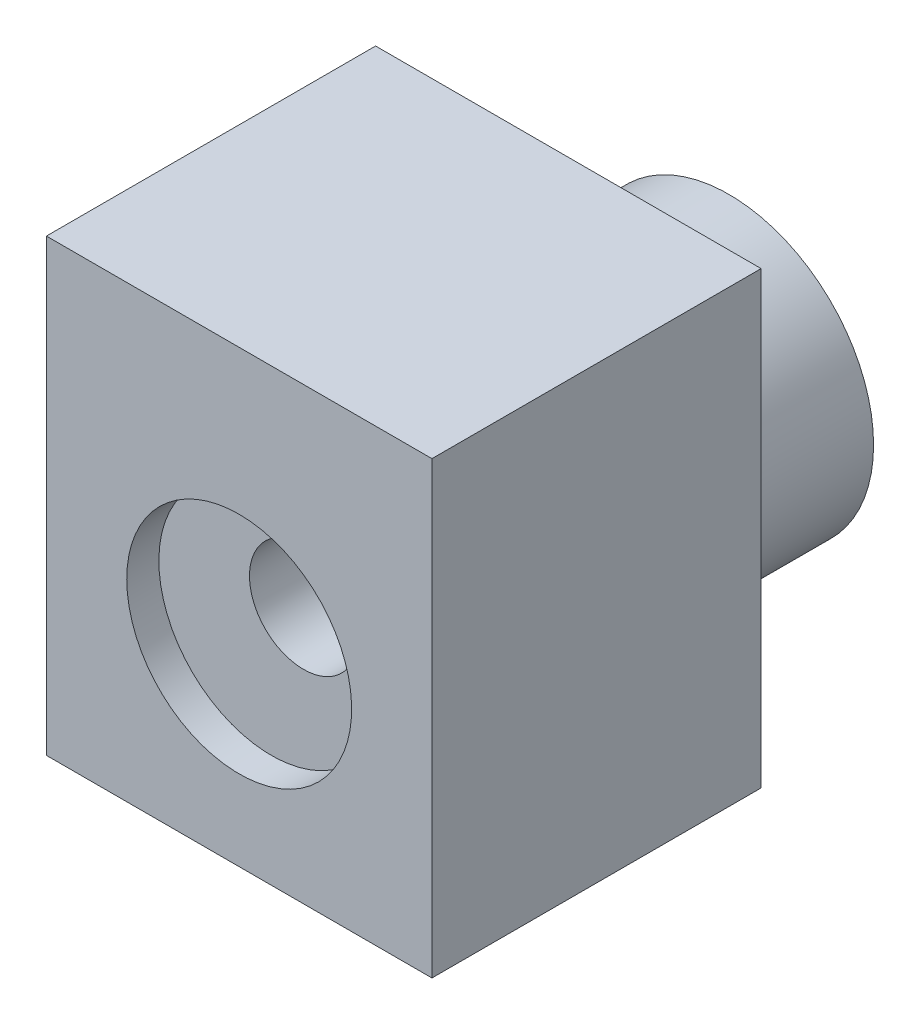
ISO-10303-21;
HEADER;
FILE_DESCRIPTION(('STEP AP214'),'2;1');
FILE_NAME('part.step','',(''),(''),'','','');
FILE_SCHEMA(('AUTOMOTIVE_DESIGN { 1 0 10303 214 1 1 1 1 }'));
ENDSEC;
DATA;
#1=APPLICATION_CONTEXT('core data for automotive mechanical design processes');
#2=APPLICATION_PROTOCOL_DEFINITION('international standard','automotive_design',2000,#1);
#3=PRODUCT_CONTEXT('',#1,'mechanical');
#4=PRODUCT('Part','Part','',(#3));
#5=PRODUCT_RELATED_PRODUCT_CATEGORY('part','',(#4));
#6=PRODUCT_DEFINITION_FORMATION('','',#4);
#7=PRODUCT_DEFINITION_CONTEXT('part definition',#1,'design');
#8=PRODUCT_DEFINITION('design','',#6,#7);
#9=PRODUCT_DEFINITION_SHAPE('','',#8);
#10=(LENGTH_UNIT() NAMED_UNIT(*) SI_UNIT(.MILLI.,.METRE.));
#11=(NAMED_UNIT(*) PLANE_ANGLE_UNIT() SI_UNIT($,.RADIAN.));
#12=(NAMED_UNIT(*) SI_UNIT($,.STERADIAN.) SOLID_ANGLE_UNIT());
#13=UNCERTAINTY_MEASURE_WITH_UNIT(LENGTH_MEASURE(1.E-05),#10,'distance_accuracy_value','');
#14=(GEOMETRIC_REPRESENTATION_CONTEXT(3) GLOBAL_UNCERTAINTY_ASSIGNED_CONTEXT((#13)) GLOBAL_UNIT_ASSIGNED_CONTEXT((#10,
#11,#12)) REPRESENTATION_CONTEXT('',''));
#15=CARTESIAN_POINT('',(0.,0.,0.));
#16=DIRECTION('',(0.,0.,1.));
#17=DIRECTION('',(1.,0.,0.));
#18=AXIS2_PLACEMENT_3D('',#15,#16,#17);
#19=CARTESIAN_POINT('',(-30.,40.,-65.228721396662));
#20=DIRECTION('',(0.,0.,1.));
#21=DIRECTION('',(1.,0.,0.));
#22=AXIS2_PLACEMENT_3D('',#19,#20,#21);
#23=PLANE('',#22);
#24=DIRECTION('',(0.,-1.,0.));
#25=VECTOR('',#24,1.);
#26=CARTESIAN_POINT('',(30.,40.,-65.228721396662));
#27=LINE('',#26,#25);
#28=CARTESIAN_POINT('',(30.,40.,-65.228721396662));
#29=VERTEX_POINT('',#28);
#30=CARTESIAN_POINT('',(30.,-30.,-65.228721396662));
#31=VERTEX_POINT('',#30);
#32=EDGE_CURVE('E57',#29,#31,#27,.T.);
#33=ORIENTED_EDGE('',*,*,#32,.T.);
#34=DIRECTION('',(-1.,0.,0.));
#35=VECTOR('',#34,1.);
#36=CARTESIAN_POINT('',(-30.,-30.,-65.228721396662));
#37=LINE('',#36,#35);
#38=CARTESIAN_POINT('',(-30.,-30.,-65.228721396662));
#39=VERTEX_POINT('',#38);
#40=EDGE_CURVE('E216',#31,#39,#37,.T.);
#41=ORIENTED_EDGE('',*,*,#40,.T.);
#42=DIRECTION('',(0.,-1.,0.));
#43=VECTOR('',#42,1.);
#44=CARTESIAN_POINT('',(-30.,40.,-65.228721396662));
#45=LINE('',#44,#43);
#46=CARTESIAN_POINT('',(-30.,40.,-65.228721396662));
#47=VERTEX_POINT('',#46);
#48=EDGE_CURVE('E239',#47,#39,#45,.T.);
#49=ORIENTED_EDGE('',*,*,#48,.F.);
#50=DIRECTION('',(-1.,0.,0.));
#51=VECTOR('',#50,1.);
#52=CARTESIAN_POINT('',(-30.,40.,-65.228721396662));
#53=LINE('',#52,#51);
#54=EDGE_CURVE('E229',#29,#47,#53,.T.);
#55=ORIENTED_EDGE('',*,*,#54,.F.);
#56=EDGE_LOOP('',(#33,#41,#49,#55));
#57=FACE_BOUND('',#56,.T.);
#58=CARTESIAN_POINT('',(0.,0.,-65.228721396662));
#59=DIRECTION('',(0.,0.,1.));
#60=DIRECTION('',(1.,0.,0.));
#61=AXIS2_PLACEMENT_3D('',#58,#59,#60);
#62=CIRCLE('',#61,22.5);
#63=CARTESIAN_POINT('',(22.5,0.,-65.228721396662));
#64=VERTEX_POINT('',#63);
#65=EDGE_CURVE('E14',#64,#64,#62,.F.);
#66=ORIENTED_EDGE('',*,*,#65,.F.);
#67=EDGE_LOOP('',(#66));
#68=FACE_BOUND('',#67,.T.);
#69=ADVANCED_FACE('F49',(#57,#68),#23,.F.);
#70=CARTESIAN_POINT('',(-30.,40.,-14.));
#71=DIRECTION('',(1.,0.,0.));
#72=DIRECTION('',(0.,0.,-1.));
#73=AXIS2_PLACEMENT_3D('',#70,#71,#72);
#74=PLANE('',#73);
#75=ORIENTED_EDGE('',*,*,#48,.T.);
#76=DIRECTION('',(0.,0.,1.));
#77=VECTOR('',#76,1.);
#78=CARTESIAN_POINT('',(-30.,-30.,-14.));
#79=LINE('',#78,#77);
#80=CARTESIAN_POINT('',(-30.,-30.,-14.));
#81=VERTEX_POINT('',#80);
#82=EDGE_CURVE('E220',#39,#81,#79,.T.);
#83=ORIENTED_EDGE('',*,*,#82,.T.);
#84=DIRECTION('',(0.,-1.,0.));
#85=VECTOR('',#84,1.);
#86=CARTESIAN_POINT('',(-30.,40.,-14.));
#87=LINE('',#86,#85);
#88=CARTESIAN_POINT('',(-30.,40.,-14.));
#89=VERTEX_POINT('',#88);
#90=EDGE_CURVE('E237',#89,#81,#87,.T.);
#91=ORIENTED_EDGE('',*,*,#90,.F.);
#92=DIRECTION('',(0.,0.,1.));
#93=VECTOR('',#92,1.);
#94=CARTESIAN_POINT('',(-30.,40.,-14.));
#95=LINE('',#94,#93);
#96=EDGE_CURVE('E231',#47,#89,#95,.T.);
#97=ORIENTED_EDGE('',*,*,#96,.F.);
#98=EDGE_LOOP('',(#75,#83,#91,#97));
#99=FACE_BOUND('',#98,.T.);
#100=DIRECTION('',(0.,1.,0.));
#101=VECTOR('',#100,1.);
#102=CARTESIAN_POINT('',(-30.,-26.5,-55.228721396662));
#103=LINE('',#102,#101);
#104=CARTESIAN_POINT('',(-30.,-26.5,-55.228721396662));
#105=VERTEX_POINT('',#104);
#106=CARTESIAN_POINT('',(-30.,26.5,-55.228721396662));
#107=VERTEX_POINT('',#106);
#108=EDGE_CURVE('E184',#105,#107,#103,.T.);
#109=ORIENTED_EDGE('',*,*,#108,.F.);
#110=DIRECTION('',(0.,0.,1.));
#111=VECTOR('',#110,1.);
#112=CARTESIAN_POINT('',(-30.,-26.5,-60.228721396662));
#113=LINE('',#112,#111);
#114=CARTESIAN_POINT('',(-30.,-26.5,-60.228721396662));
#115=VERTEX_POINT('',#114);
#116=EDGE_CURVE('E187',#115,#105,#113,.T.);
#117=ORIENTED_EDGE('',*,*,#116,.F.);
#118=DIRECTION('',(0.,-1.,0.));
#119=VECTOR('',#118,1.);
#120=CARTESIAN_POINT('',(-30.,-26.5,-60.228721396662));
#121=LINE('',#120,#119);
#122=CARTESIAN_POINT('',(-30.,26.5,-60.228721396662));
#123=VERTEX_POINT('',#122);
#124=EDGE_CURVE('E190',#123,#115,#121,.T.);
#125=ORIENTED_EDGE('',*,*,#124,.F.);
#126=DIRECTION('',(0.,0.,-1.));
#127=VECTOR('',#126,1.);
#128=CARTESIAN_POINT('',(-30.,26.5,-60.228721396662));
#129=LINE('',#128,#127);
#130=EDGE_CURVE('E72',#107,#123,#129,.T.);
#131=ORIENTED_EDGE('',*,*,#130,.F.);
#132=EDGE_LOOP('',(#109,#117,#125,#131));
#133=FACE_BOUND('',#132,.T.);
#134=DIRECTION('',(0.,-1.,0.));
#135=VECTOR('',#134,1.);
#136=CARTESIAN_POINT('',(-30.,-26.5,-19.));
#137=LINE('',#136,#135);
#138=CARTESIAN_POINT('',(-30.,26.5,-19.));
#139=VERTEX_POINT('',#138);
#140=CARTESIAN_POINT('',(-30.,-26.5,-19.));
#141=VERTEX_POINT('',#140);
#142=EDGE_CURVE('E64',#139,#141,#137,.T.);
#143=ORIENTED_EDGE('',*,*,#142,.T.);
#144=DIRECTION('',(0.,0.,-1.));
#145=VECTOR('',#144,1.);
#146=CARTESIAN_POINT('',(-30.,-26.5,-19.));
#147=LINE('',#146,#145);
#148=CARTESIAN_POINT('',(-30.,-26.5,-24.));
#149=VERTEX_POINT('',#148);
#150=EDGE_CURVE('E174',#141,#149,#147,.T.);
#151=ORIENTED_EDGE('',*,*,#150,.T.);
#152=DIRECTION('',(0.,1.,0.));
#153=VECTOR('',#152,1.);
#154=CARTESIAN_POINT('',(-30.,-26.5,-24.));
#155=LINE('',#154,#153);
#156=CARTESIAN_POINT('',(-30.,26.5,-24.));
#157=VERTEX_POINT('',#156);
#158=EDGE_CURVE('E149',#149,#157,#155,.T.);
#159=ORIENTED_EDGE('',*,*,#158,.T.);
#160=DIRECTION('',(0.,0.,1.));
#161=VECTOR('',#160,1.);
#162=CARTESIAN_POINT('',(-30.,26.5,-19.));
#163=LINE('',#162,#161);
#164=EDGE_CURVE('E144',#157,#139,#163,.T.);
#165=ORIENTED_EDGE('',*,*,#164,.T.);
#166=EDGE_LOOP('',(#143,#151,#159,#165));
#167=FACE_BOUND('',#166,.T.);
#168=ADVANCED_FACE('F261',(#99,#133,#167),#74,.F.);
#169=CARTESIAN_POINT('',(0.,0.,-24.));
#170=DIRECTION('',(0.,0.,1.));
#171=DIRECTION('',(1.,0.,0.));
#172=AXIS2_PLACEMENT_3D('',#169,#170,#171);
#173=CYLINDRICAL_SURFACE('',#172,17.5);
#174=CARTESIAN_POINT('',(0.,0.,-14.));
#175=DIRECTION('',(0.,0.,-1.));
#176=DIRECTION('',(-1.,0.,0.));
#177=AXIS2_PLACEMENT_3D('',#174,#175,#176);
#178=CIRCLE('',#177,17.5);
#179=CARTESIAN_POINT('',(-17.5,0.,-14.));
#180=VERTEX_POINT('',#179);
#181=EDGE_CURVE('E166',#180,#180,#178,.T.);
#182=ORIENTED_EDGE('',*,*,#181,.F.);
#183=EDGE_LOOP('',(#182));
#184=FACE_BOUND('',#183,.T.);
#185=CARTESIAN_POINT('',(0.,0.,-19.));
#186=DIRECTION('',(0.,0.,-1.));
#187=DIRECTION('',(0.,1.,0.));
#188=AXIS2_PLACEMENT_3D('',#185,#186,#187);
#189=CIRCLE('',#188,17.5);
#190=CARTESIAN_POINT('',(0.,17.5,-19.));
#191=VERTEX_POINT('',#190);
#192=EDGE_CURVE('E162',#191,#191,#189,.T.);
#193=ORIENTED_EDGE('',*,*,#192,.T.);
#194=EDGE_LOOP('',(#193));
#195=FACE_BOUND('',#194,.T.);
#196=ADVANCED_FACE('F252',(#184,#195),#173,.F.);
#197=CARTESIAN_POINT('',(0.,0.,-65.228721396662));
#198=DIRECTION('',(0.,0.,1.));
#199=DIRECTION('',(1.,0.,0.));
#200=AXIS2_PLACEMENT_3D('',#197,#198,#199);
#201=CYLINDRICAL_SURFACE('',#200,8.4);
#202=CARTESIAN_POINT('',(0.,0.,-55.228721396662));
#203=DIRECTION('',(0.,0.,-1.));
#204=DIRECTION('',(-1.,0.,0.));
#205=AXIS2_PLACEMENT_3D('',#202,#203,#204);
#206=CIRCLE('',#205,8.4);
#207=CARTESIAN_POINT('',(-8.39999999999997,0.,-55.228721396662));
#208=VERTEX_POINT('',#207);
#209=EDGE_CURVE('E217',#208,#208,#206,.F.);
#210=ORIENTED_EDGE('',*,*,#209,.F.);
#211=EDGE_LOOP('',(#210));
#212=FACE_BOUND('',#211,.T.);
#213=CARTESIAN_POINT('',(0.,0.,-24.));
#214=DIRECTION('',(0.,0.,1.));
#215=DIRECTION('',(1.,0.,0.));
#216=AXIS2_PLACEMENT_3D('',#213,#214,#215);
#217=CIRCLE('',#216,8.4);
#218=CARTESIAN_POINT('',(8.40000000000003,0.,-24.));
#219=VERTEX_POINT('',#218);
#220=EDGE_CURVE('E181',#219,#219,#217,.F.);
#221=ORIENTED_EDGE('',*,*,#220,.F.);
#222=EDGE_LOOP('',(#221));
#223=FACE_BOUND('',#222,.T.);
#224=ADVANCED_FACE('F250',(#212,#223),#201,.F.);
#225=CARTESIAN_POINT('',(30.,40.,-14.));
#226=DIRECTION('',(-1.,0.,0.));
#227=DIRECTION('',(0.,0.,1.));
#228=AXIS2_PLACEMENT_3D('',#225,#226,#227);
#229=PLANE('',#228);
#230=DIRECTION('',(0.,-1.,0.));
#231=VECTOR('',#230,1.);
#232=CARTESIAN_POINT('',(30.,40.,-14.));
#233=LINE('',#232,#231);
#234=CARTESIAN_POINT('',(30.,40.,-14.));
#235=VERTEX_POINT('',#234);
#236=CARTESIAN_POINT('',(30.,-30.,-14.));
#237=VERTEX_POINT('',#236);
#238=EDGE_CURVE('E235',#235,#237,#233,.T.);
#239=ORIENTED_EDGE('',*,*,#238,.T.);
#240=DIRECTION('',(0.,0.,-1.));
#241=VECTOR('',#240,1.);
#242=CARTESIAN_POINT('',(30.,-30.,-14.));
#243=LINE('',#242,#241);
#244=EDGE_CURVE('E213',#237,#31,#243,.T.);
#245=ORIENTED_EDGE('',*,*,#244,.T.);
#246=ORIENTED_EDGE('',*,*,#32,.F.);
#247=DIRECTION('',(0.,0.,-1.));
#248=VECTOR('',#247,1.);
#249=CARTESIAN_POINT('',(30.,40.,-14.));
#250=LINE('',#249,#248);
#251=EDGE_CURVE('E226',#235,#29,#250,.T.);
#252=ORIENTED_EDGE('',*,*,#251,.F.);
#253=EDGE_LOOP('',(#239,#245,#246,#252));
#254=FACE_BOUND('',#253,.T.);
#255=ADVANCED_FACE('F51',(#254),#229,.F.);
#256=CARTESIAN_POINT('',(-30.,40.,-14.));
#257=DIRECTION('',(0.,0.,-1.));
#258=DIRECTION('',(-1.,0.,0.));
#259=AXIS2_PLACEMENT_3D('',#256,#257,#258);
#260=PLANE('',#259);
#261=ORIENTED_EDGE('',*,*,#181,.T.);
#262=EDGE_LOOP('',(#261));
#263=FACE_BOUND('',#262,.T.);
#264=ORIENTED_EDGE('',*,*,#90,.T.);
#265=DIRECTION('',(1.,0.,0.));
#266=VECTOR('',#265,1.);
#267=CARTESIAN_POINT('',(-30.,-30.,-14.));
#268=LINE('',#267,#266);
#269=EDGE_CURVE('E223',#81,#237,#268,.T.);
#270=ORIENTED_EDGE('',*,*,#269,.T.);
#271=ORIENTED_EDGE('',*,*,#238,.F.);
#272=DIRECTION('',(1.,0.,0.));
#273=VECTOR('',#272,1.);
#274=CARTESIAN_POINT('',(-30.,40.,-14.));
#275=LINE('',#274,#273);
#276=EDGE_CURVE('E233',#89,#235,#275,.T.);
#277=ORIENTED_EDGE('',*,*,#276,.F.);
#278=EDGE_LOOP('',(#264,#270,#271,#277));
#279=FACE_BOUND('',#278,.T.);
#280=ADVANCED_FACE('F259',(#263,#279),#260,.F.);
#281=CARTESIAN_POINT('',(0.,40.,0.));
#282=DIRECTION('',(0.,-1.,0.));
#283=DIRECTION('',(0.,0.,-1.));
#284=AXIS2_PLACEMENT_3D('',#281,#282,#283);
#285=PLANE('',#284);
#286=ORIENTED_EDGE('',*,*,#251,.T.);
#287=ORIENTED_EDGE('',*,*,#54,.T.);
#288=ORIENTED_EDGE('',*,*,#96,.T.);
#289=ORIENTED_EDGE('',*,*,#276,.T.);
#290=EDGE_LOOP('',(#286,#287,#288,#289));
#291=FACE_BOUND('',#290,.T.);
#292=ADVANCED_FACE('F278',(#291),#285,.F.);
#293=CARTESIAN_POINT('',(0.,-30.,0.));
#294=DIRECTION('',(0.,-1.,0.));
#295=DIRECTION('',(0.,0.,-1.));
#296=AXIS2_PLACEMENT_3D('',#293,#294,#295);
#297=PLANE('',#296);
#298=ORIENTED_EDGE('',*,*,#244,.F.);
#299=ORIENTED_EDGE('',*,*,#269,.F.);
#300=ORIENTED_EDGE('',*,*,#82,.F.);
#301=ORIENTED_EDGE('',*,*,#40,.F.);
#302=EDGE_LOOP('',(#298,#299,#300,#301));
#303=FACE_BOUND('',#302,.T.);
#304=ADVANCED_FACE('F281',(#303),#297,.T.);
#305=CARTESIAN_POINT('',(0.,0.,-55.228721396662));
#306=DIRECTION('',(0.,0.,-1.));
#307=DIRECTION('',(-1.,0.,0.));
#308=AXIS2_PLACEMENT_3D('',#305,#306,#307);
#309=PLANE('',#308);
#310=ORIENTED_EDGE('',*,*,#209,.T.);
#311=EDGE_LOOP('',(#310));
#312=FACE_BOUND('',#311,.T.);
#313=DIRECTION('',(-1.,0.,0.));
#314=VECTOR('',#313,1.);
#315=CARTESIAN_POINT('',(103.235326616825,-26.5,-55.228721396662));
#316=LINE('',#315,#314);
#317=CARTESIAN_POINT('',(25.,-26.5,-55.228721396662));
#318=VERTEX_POINT('',#317);
#319=EDGE_CURVE('E195',#318,#105,#316,.T.);
#320=ORIENTED_EDGE('',*,*,#319,.T.);
#321=ORIENTED_EDGE('',*,*,#108,.T.);
#322=DIRECTION('',(-1.,0.,0.));
#323=VECTOR('',#322,1.);
#324=CARTESIAN_POINT('',(103.235326616825,26.5,-55.228721396662));
#325=LINE('',#324,#323);
#326=CARTESIAN_POINT('',(25.,26.5,-55.228721396662));
#327=VERTEX_POINT('',#326);
#328=EDGE_CURVE('E204',#327,#107,#325,.T.);
#329=ORIENTED_EDGE('',*,*,#328,.F.);
#330=DIRECTION('',(0.,1.,0.));
#331=VECTOR('',#330,1.);
#332=CARTESIAN_POINT('',(25.,-26.5,-55.228721396662));
#333=LINE('',#332,#331);
#334=EDGE_CURVE('E205',#318,#327,#333,.T.);
#335=ORIENTED_EDGE('',*,*,#334,.F.);
#336=EDGE_LOOP('',(#320,#321,#329,#335));
#337=FACE_BOUND('',#336,.T.);
#338=ADVANCED_FACE('F284',(#312,#337),#309,.T.);
#339=CARTESIAN_POINT('',(0.,0.,-55.228721396662));
#340=DIRECTION('',(0.,0.,-1.));
#341=DIRECTION('',(-1.,0.,0.));
#342=AXIS2_PLACEMENT_3D('',#339,#340,#341);
#343=CYLINDRICAL_SURFACE('',#342,17.5);
#344=CARTESIAN_POINT('',(0.,0.,-60.228721396662));
#345=DIRECTION('',(0.,0.,-1.));
#346=DIRECTION('',(0.,1.,0.));
#347=AXIS2_PLACEMENT_3D('',#344,#345,#346);
#348=CIRCLE('',#347,17.5);
#349=CARTESIAN_POINT('',(0.,17.5,-60.228721396662));
#350=VERTEX_POINT('',#349);
#351=EDGE_CURVE('E212',#350,#350,#348,.F.);
#352=ORIENTED_EDGE('',*,*,#351,.T.);
#353=EDGE_LOOP('',(#352));
#354=FACE_BOUND('',#353,.T.);
#355=CARTESIAN_POINT('',(0.,0.,-90.228721396662));
#356=DIRECTION('',(0.,0.,-1.));
#357=DIRECTION('',(-1.,0.,0.));
#358=AXIS2_PLACEMENT_3D('',#355,#356,#357);
#359=CIRCLE('',#358,17.5);
#360=CARTESIAN_POINT('',(-17.5,0.,-90.228721396662));
#361=VERTEX_POINT('',#360);
#362=EDGE_CURVE('E315',#361,#361,#359,.T.);
#363=ORIENTED_EDGE('',*,*,#362,.T.);
#364=EDGE_LOOP('',(#363));
#365=FACE_BOUND('',#364,.T.);
#366=ADVANCED_FACE('F289',(#354,#365),#343,.F.);
#367=CARTESIAN_POINT('',(103.235326616825,-26.5,-60.228721396662));
#368=DIRECTION('',(0.,0.,-1.));
#369=DIRECTION('',(0.,1.,0.));
#370=AXIS2_PLACEMENT_3D('',#367,#368,#369);
#371=PLANE('',#370);
#372=DIRECTION('',(-1.,0.,0.));
#373=VECTOR('',#372,1.);
#374=CARTESIAN_POINT('',(103.235326616825,26.5,-60.228721396662));
#375=LINE('',#374,#373);
#376=CARTESIAN_POINT('',(25.,26.5,-60.228721396662));
#377=VERTEX_POINT('',#376);
#378=EDGE_CURVE('E200',#377,#123,#375,.T.);
#379=ORIENTED_EDGE('',*,*,#378,.T.);
#380=ORIENTED_EDGE('',*,*,#124,.T.);
#381=DIRECTION('',(-1.,0.,0.));
#382=VECTOR('',#381,1.);
#383=CARTESIAN_POINT('',(103.235326616825,-26.5,-60.228721396662));
#384=LINE('',#383,#382);
#385=CARTESIAN_POINT('',(25.,-26.5,-60.228721396662));
#386=VERTEX_POINT('',#385);
#387=EDGE_CURVE('E199',#386,#115,#384,.T.);
#388=ORIENTED_EDGE('',*,*,#387,.F.);
#389=DIRECTION('',(0.,-1.,0.));
#390=VECTOR('',#389,1.);
#391=CARTESIAN_POINT('',(25.,-26.5,-60.228721396662));
#392=LINE('',#391,#390);
#393=EDGE_CURVE('E196',#377,#386,#392,.T.);
#394=ORIENTED_EDGE('',*,*,#393,.F.);
#395=EDGE_LOOP('',(#379,#380,#388,#394));
#396=FACE_BOUND('',#395,.T.);
#397=ORIENTED_EDGE('',*,*,#351,.F.);
#398=EDGE_LOOP('',(#397));
#399=FACE_BOUND('',#398,.T.);
#400=ADVANCED_FACE('F346',(#396,#399),#371,.F.);
#401=CARTESIAN_POINT('',(25.,0.,0.));
#402=DIRECTION('',(1.,0.,0.));
#403=DIRECTION('',(0.,0.,-1.));
#404=AXIS2_PLACEMENT_3D('',#401,#402,#403);
#405=PLANE('',#404);
#406=ORIENTED_EDGE('',*,*,#393,.T.);
#407=DIRECTION('',(0.,0.,1.));
#408=VECTOR('',#407,1.);
#409=CARTESIAN_POINT('',(25.,-26.5,-60.228721396662));
#410=LINE('',#409,#408);
#411=EDGE_CURVE('E183',#386,#318,#410,.T.);
#412=ORIENTED_EDGE('',*,*,#411,.T.);
#413=ORIENTED_EDGE('',*,*,#334,.T.);
#414=DIRECTION('',(0.,0.,-1.));
#415=VECTOR('',#414,1.);
#416=CARTESIAN_POINT('',(25.,26.5,-60.228721396662));
#417=LINE('',#416,#415);
#418=EDGE_CURVE('E201',#327,#377,#417,.T.);
#419=ORIENTED_EDGE('',*,*,#418,.T.);
#420=EDGE_LOOP('',(#406,#412,#413,#419));
#421=FACE_BOUND('',#420,.T.);
#422=ADVANCED_FACE('F349',(#421),#405,.F.);
#423=CARTESIAN_POINT('',(103.235326616825,-26.5,-60.228721396662));
#424=DIRECTION('',(0.,-1.,0.));
#425=DIRECTION('',(0.,0.,-1.));
#426=AXIS2_PLACEMENT_3D('',#423,#424,#425);
#427=PLANE('',#426);
#428=ORIENTED_EDGE('',*,*,#387,.T.);
#429=ORIENTED_EDGE('',*,*,#116,.T.);
#430=ORIENTED_EDGE('',*,*,#319,.F.);
#431=ORIENTED_EDGE('',*,*,#411,.F.);
#432=EDGE_LOOP('',(#428,#429,#430,#431));
#433=FACE_BOUND('',#432,.T.);
#434=ADVANCED_FACE('F353',(#433),#427,.F.);
#435=CARTESIAN_POINT('',(103.235326616825,26.5,-60.228721396662));
#436=DIRECTION('',(0.,1.,0.));
#437=DIRECTION('',(0.,0.,1.));
#438=AXIS2_PLACEMENT_3D('',#435,#436,#437);
#439=PLANE('',#438);
#440=ORIENTED_EDGE('',*,*,#328,.T.);
#441=ORIENTED_EDGE('',*,*,#130,.T.);
#442=ORIENTED_EDGE('',*,*,#378,.F.);
#443=ORIENTED_EDGE('',*,*,#418,.F.);
#444=EDGE_LOOP('',(#440,#441,#442,#443));
#445=FACE_BOUND('',#444,.T.);
#446=ADVANCED_FACE('F344',(#445),#439,.F.);
#447=CARTESIAN_POINT('',(0.,0.,-24.));
#448=DIRECTION('',(0.,0.,1.));
#449=DIRECTION('',(-1.,0.,0.));
#450=AXIS2_PLACEMENT_3D('',#447,#448,#449);
#451=PLANE('',#450);
#452=ORIENTED_EDGE('',*,*,#220,.T.);
#453=EDGE_LOOP('',(#452));
#454=FACE_BOUND('',#453,.T.);
#455=DIRECTION('',(0.,1.,0.));
#456=VECTOR('',#455,1.);
#457=CARTESIAN_POINT('',(25.,-26.5,-24.));
#458=LINE('',#457,#456);
#459=CARTESIAN_POINT('',(25.,-26.5,-24.));
#460=VERTEX_POINT('',#459);
#461=CARTESIAN_POINT('',(25.,26.5,-24.));
#462=VERTEX_POINT('',#461);
#463=EDGE_CURVE('E154',#460,#462,#458,.T.);
#464=ORIENTED_EDGE('',*,*,#463,.T.);
#465=DIRECTION('',(-1.,0.,0.));
#466=VECTOR('',#465,1.);
#467=CARTESIAN_POINT('',(103.235326616825,26.5,-24.));
#468=LINE('',#467,#466);
#469=EDGE_CURVE('E139',#462,#157,#468,.T.);
#470=ORIENTED_EDGE('',*,*,#469,.T.);
#471=ORIENTED_EDGE('',*,*,#158,.F.);
#472=DIRECTION('',(-1.,0.,0.));
#473=VECTOR('',#472,1.);
#474=CARTESIAN_POINT('',(103.235326616825,-26.5,-24.));
#475=LINE('',#474,#473);
#476=EDGE_CURVE('E160',#460,#149,#475,.T.);
#477=ORIENTED_EDGE('',*,*,#476,.F.);
#478=EDGE_LOOP('',(#464,#470,#471,#477));
#479=FACE_BOUND('',#478,.T.);
#480=ADVANCED_FACE('F159',(#454,#479),#451,.T.);
#481=CARTESIAN_POINT('',(103.235326616825,-26.5,-19.));
#482=DIRECTION('',(0.,0.,-1.));
#483=DIRECTION('',(0.,1.,0.));
#484=AXIS2_PLACEMENT_3D('',#481,#482,#483);
#485=PLANE('',#484);
#486=ORIENTED_EDGE('',*,*,#192,.F.);
#487=EDGE_LOOP('',(#486));
#488=FACE_BOUND('',#487,.T.);
#489=DIRECTION('',(0.,-1.,0.));
#490=VECTOR('',#489,1.);
#491=CARTESIAN_POINT('',(25.,-26.5,-19.));
#492=LINE('',#491,#490);
#493=CARTESIAN_POINT('',(25.,26.5,-19.));
#494=VERTEX_POINT('',#493);
#495=CARTESIAN_POINT('',(25.,-26.5,-19.));
#496=VERTEX_POINT('',#495);
#497=EDGE_CURVE('E157',#494,#496,#492,.T.);
#498=ORIENTED_EDGE('',*,*,#497,.T.);
#499=DIRECTION('',(-1.,0.,0.));
#500=VECTOR('',#499,1.);
#501=CARTESIAN_POINT('',(103.235326616825,-26.5,-19.));
#502=LINE('',#501,#500);
#503=EDGE_CURVE('E172',#496,#141,#502,.T.);
#504=ORIENTED_EDGE('',*,*,#503,.T.);
#505=ORIENTED_EDGE('',*,*,#142,.F.);
#506=DIRECTION('',(-1.,0.,0.));
#507=VECTOR('',#506,1.);
#508=CARTESIAN_POINT('',(103.235326616825,26.5,-19.));
#509=LINE('',#508,#507);
#510=EDGE_CURVE('E176',#494,#139,#509,.T.);
#511=ORIENTED_EDGE('',*,*,#510,.F.);
#512=EDGE_LOOP('',(#498,#504,#505,#511));
#513=FACE_BOUND('',#512,.T.);
#514=ADVANCED_FACE('F338',(#488,#513),#485,.T.);
#515=CARTESIAN_POINT('',(103.235326616825,-26.5,-19.));
#516=DIRECTION('',(0.,1.,0.));
#517=DIRECTION('',(0.,0.,1.));
#518=AXIS2_PLACEMENT_3D('',#515,#516,#517);
#519=PLANE('',#518);
#520=DIRECTION('',(0.,0.,-1.));
#521=VECTOR('',#520,1.);
#522=CARTESIAN_POINT('',(25.,-26.5,-19.));
#523=LINE('',#522,#521);
#524=EDGE_CURVE('E163',#496,#460,#523,.T.);
#525=ORIENTED_EDGE('',*,*,#524,.T.);
#526=ORIENTED_EDGE('',*,*,#476,.T.);
#527=ORIENTED_EDGE('',*,*,#150,.F.);
#528=ORIENTED_EDGE('',*,*,#503,.F.);
#529=EDGE_LOOP('',(#525,#526,#527,#528));
#530=FACE_BOUND('',#529,.T.);
#531=ADVANCED_FACE('F335',(#530),#519,.T.);
#532=CARTESIAN_POINT('',(103.235326616825,26.5,-19.));
#533=DIRECTION('',(0.,-1.,0.));
#534=DIRECTION('',(0.,0.,-1.));
#535=AXIS2_PLACEMENT_3D('',#532,#533,#534);
#536=PLANE('',#535);
#537=DIRECTION('',(0.,0.,1.));
#538=VECTOR('',#537,1.);
#539=CARTESIAN_POINT('',(25.,26.5,-19.));
#540=LINE('',#539,#538);
#541=EDGE_CURVE('E142',#462,#494,#540,.T.);
#542=ORIENTED_EDGE('',*,*,#541,.T.);
#543=ORIENTED_EDGE('',*,*,#510,.T.);
#544=ORIENTED_EDGE('',*,*,#164,.F.);
#545=ORIENTED_EDGE('',*,*,#469,.F.);
#546=EDGE_LOOP('',(#542,#543,#544,#545));
#547=FACE_BOUND('',#546,.T.);
#548=ADVANCED_FACE('F141',(#547),#536,.T.);
#549=CARTESIAN_POINT('',(25.,0.,0.));
#550=DIRECTION('',(1.,0.,0.));
#551=DIRECTION('',(0.,0.,-1.));
#552=AXIS2_PLACEMENT_3D('',#549,#550,#551);
#553=PLANE('',#552);
#554=ORIENTED_EDGE('',*,*,#541,.F.);
#555=ORIENTED_EDGE('',*,*,#463,.F.);
#556=ORIENTED_EDGE('',*,*,#524,.F.);
#557=ORIENTED_EDGE('',*,*,#497,.F.);
#558=EDGE_LOOP('',(#554,#555,#556,#557));
#559=FACE_BOUND('',#558,.T.);
#560=ADVANCED_FACE('F153',(#559),#553,.F.);
#561=CARTESIAN_POINT('',(0.,0.,-90.228721396662));
#562=DIRECTION('',(0.,0.,-1.));
#563=DIRECTION('',(-1.,0.,0.));
#564=AXIS2_PLACEMENT_3D('',#561,#562,#563);
#565=PLANE('',#564);
#566=CARTESIAN_POINT('',(0.,0.,-90.228721396662));
#567=DIRECTION('',(0.,0.,-1.));
#568=DIRECTION('',(-1.,0.,0.));
#569=AXIS2_PLACEMENT_3D('',#566,#567,#568);
#570=CIRCLE('',#569,22.5);
#571=CARTESIAN_POINT('',(-22.5,0.,-90.228721396662));
#572=VERTEX_POINT('',#571);
#573=EDGE_CURVE('E178',#572,#572,#570,.T.);
#574=ORIENTED_EDGE('',*,*,#573,.T.);
#575=EDGE_LOOP('',(#574));
#576=FACE_BOUND('',#575,.T.);
#577=ORIENTED_EDGE('',*,*,#362,.F.);
#578=EDGE_LOOP('',(#577));
#579=FACE_BOUND('',#578,.T.);
#580=ADVANCED_FACE('F320',(#576,#579),#565,.T.);
#581=CARTESIAN_POINT('',(0.,0.,-90.228721396662));
#582=DIRECTION('',(0.,0.,1.));
#583=DIRECTION('',(1.,0.,0.));
#584=AXIS2_PLACEMENT_3D('',#581,#582,#583);
#585=CYLINDRICAL_SURFACE('',#584,22.5);
#586=ORIENTED_EDGE('',*,*,#573,.F.);
#587=EDGE_LOOP('',(#586));
#588=FACE_BOUND('',#587,.T.);
#589=ORIENTED_EDGE('',*,*,#65,.T.);
#590=EDGE_LOOP('',(#589));
#591=FACE_BOUND('',#590,.T.);
#592=ADVANCED_FACE('F322',(#588,#591),#585,.T.);
#593=CLOSED_SHELL('',(#69,#168,#196,#224,#255,#280,#292,#304,#338,#366,#400,#422,#434,#446,#480,
#514,#531,#548,#560,#580,#592));
#594=MANIFOLD_SOLID_BREP('B2',#593);
#595=ADVANCED_BREP_SHAPE_REPRESENTATION('',(#18,#594),#14);
#596=SHAPE_DEFINITION_REPRESENTATION(#9,#595);
ENDSEC;
END-ISO-10303-21;
